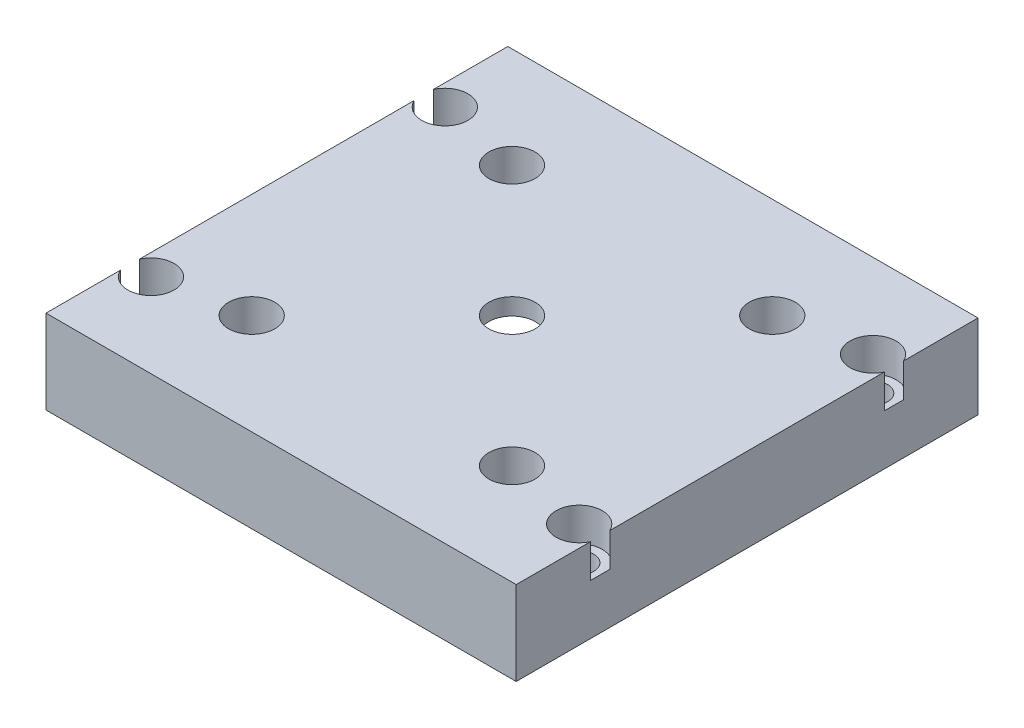
ISO-10303-21;
HEADER;
FILE_DESCRIPTION(('STEP AP214'),'2;1');
FILE_NAME('part.step','',(''),(''),'','','');
FILE_SCHEMA(('AUTOMOTIVE_DESIGN { 1 0 10303 214 1 1 1 1 }'));
ENDSEC;
DATA;
#1=APPLICATION_CONTEXT('core data for automotive mechanical design processes');
#2=APPLICATION_PROTOCOL_DEFINITION('international standard','automotive_design',2000,#1);
#3=PRODUCT_CONTEXT('',#1,'mechanical');
#4=PRODUCT('Part','Part','',(#3));
#5=PRODUCT_RELATED_PRODUCT_CATEGORY('part','',(#4));
#6=PRODUCT_DEFINITION_FORMATION('','',#4);
#7=PRODUCT_DEFINITION_CONTEXT('part definition',#1,'design');
#8=PRODUCT_DEFINITION('design','',#6,#7);
#9=PRODUCT_DEFINITION_SHAPE('','',#8);
#10=(LENGTH_UNIT() NAMED_UNIT(*) SI_UNIT(.MILLI.,.METRE.));
#11=(NAMED_UNIT(*) PLANE_ANGLE_UNIT() SI_UNIT($,.RADIAN.));
#12=(NAMED_UNIT(*) SI_UNIT($,.STERADIAN.) SOLID_ANGLE_UNIT());
#13=UNCERTAINTY_MEASURE_WITH_UNIT(LENGTH_MEASURE(1.E-05),#10,'distance_accuracy_value','');
#14=(GEOMETRIC_REPRESENTATION_CONTEXT(3) GLOBAL_UNCERTAINTY_ASSIGNED_CONTEXT((#13)) GLOBAL_UNIT_ASSIGNED_CONTEXT((#10,
#11,#12)) REPRESENTATION_CONTEXT('',''));
#15=CARTESIAN_POINT('',(0.,0.,0.));
#16=DIRECTION('',(0.,0.,1.));
#17=DIRECTION('',(1.,0.,0.));
#18=AXIS2_PLACEMENT_3D('',#15,#16,#17);
#19=CARTESIAN_POINT('',(25.5,-49.,17.5));
#20=DIRECTION('',(0.,1.,0.));
#21=DIRECTION('',(0.,0.,1.));
#22=AXIS2_PLACEMENT_3D('',#19,#20,#21);
#23=CYLINDRICAL_SURFACE('',#22,1.75);
#24=CARTESIAN_POINT('',(25.5,-5.,17.5));
#25=DIRECTION('',(0.,-1.,0.));
#26=DIRECTION('',(0.,0.,-1.));
#27=AXIS2_PLACEMENT_3D('',#24,#25,#26);
#28=CIRCLE('',#27,1.75);
#29=CARTESIAN_POINT('',(25.5,-5.,15.75));
#30=VERTEX_POINT('',#29);
#31=EDGE_CURVE('E299',#30,#30,#28,.T.);
#32=ORIENTED_EDGE('',*,*,#31,.T.);
#33=EDGE_LOOP('',(#32));
#34=FACE_BOUND('',#33,.T.);
#35=CARTESIAN_POINT('',(25.5,1.,17.5));
#36=DIRECTION('',(0.,1.,0.));
#37=DIRECTION('',(0.,0.,1.));
#38=AXIS2_PLACEMENT_3D('',#35,#36,#37);
#39=CIRCLE('',#38,1.75);
#40=CARTESIAN_POINT('',(25.5,1.,19.25));
#41=VERTEX_POINT('',#40);
#42=EDGE_CURVE('E51',#41,#41,#39,.F.);
#43=ORIENTED_EDGE('',*,*,#42,.F.);
#44=EDGE_LOOP('',(#43));
#45=FACE_BOUND('',#44,.T.);
#46=ADVANCED_FACE('F47',(#34,#45),#23,.F.);
#47=CARTESIAN_POINT('',(-25.5,-49.,17.5));
#48=DIRECTION('',(0.,1.,0.));
#49=DIRECTION('',(0.,0.,1.));
#50=AXIS2_PLACEMENT_3D('',#47,#48,#49);
#51=CYLINDRICAL_SURFACE('',#50,1.75);
#52=CARTESIAN_POINT('',(-25.5,-5.,17.5));
#53=DIRECTION('',(0.,-1.,0.));
#54=DIRECTION('',(0.,0.,-1.));
#55=AXIS2_PLACEMENT_3D('',#52,#53,#54);
#56=CIRCLE('',#55,1.75);
#57=CARTESIAN_POINT('',(-25.5,-5.,15.75));
#58=VERTEX_POINT('',#57);
#59=EDGE_CURVE('E303',#58,#58,#56,.T.);
#60=ORIENTED_EDGE('',*,*,#59,.T.);
#61=EDGE_LOOP('',(#60));
#62=FACE_BOUND('',#61,.T.);
#63=CARTESIAN_POINT('',(-25.5,1.,17.5));
#64=DIRECTION('',(0.,1.,0.));
#65=DIRECTION('',(0.,0.,1.));
#66=AXIS2_PLACEMENT_3D('',#63,#64,#65);
#67=CIRCLE('',#66,1.75);
#68=CARTESIAN_POINT('',(-25.5,1.,19.25));
#69=VERTEX_POINT('',#68);
#70=EDGE_CURVE('E321',#69,#69,#67,.F.);
#71=ORIENTED_EDGE('',*,*,#70,.F.);
#72=EDGE_LOOP('',(#71));
#73=FACE_BOUND('',#72,.T.);
#74=ADVANCED_FACE('F467',(#62,#73),#51,.F.);
#75=CARTESIAN_POINT('',(25.5,-49.,-17.5));
#76=DIRECTION('',(0.,1.,0.));
#77=DIRECTION('',(0.,0.,1.));
#78=AXIS2_PLACEMENT_3D('',#75,#76,#77);
#79=CYLINDRICAL_SURFACE('',#78,1.75);
#80=CARTESIAN_POINT('',(25.5,-5.,-17.5));
#81=DIRECTION('',(0.,-1.,0.));
#82=DIRECTION('',(0.,0.,-1.));
#83=AXIS2_PLACEMENT_3D('',#80,#81,#82);
#84=CIRCLE('',#83,1.75);
#85=CARTESIAN_POINT('',(25.5,-5.,-19.25));
#86=VERTEX_POINT('',#85);
#87=EDGE_CURVE('E307',#86,#86,#84,.T.);
#88=ORIENTED_EDGE('',*,*,#87,.T.);
#89=EDGE_LOOP('',(#88));
#90=FACE_BOUND('',#89,.T.);
#91=CARTESIAN_POINT('',(25.5,1.,-17.5));
#92=DIRECTION('',(0.,1.,0.));
#93=DIRECTION('',(0.,0.,1.));
#94=AXIS2_PLACEMENT_3D('',#91,#92,#93);
#95=CIRCLE('',#94,1.75);
#96=CARTESIAN_POINT('',(25.5,1.,-15.75));
#97=VERTEX_POINT('',#96);
#98=EDGE_CURVE('E181',#97,#97,#95,.F.);
#99=ORIENTED_EDGE('',*,*,#98,.F.);
#100=EDGE_LOOP('',(#99));
#101=FACE_BOUND('',#100,.T.);
#102=ADVANCED_FACE('F469',(#90,#101),#79,.F.);
#103=CARTESIAN_POINT('',(-25.5,-49.,-17.5));
#104=DIRECTION('',(0.,1.,0.));
#105=DIRECTION('',(0.,0.,1.));
#106=AXIS2_PLACEMENT_3D('',#103,#104,#105);
#107=CYLINDRICAL_SURFACE('',#106,1.75);
#108=CARTESIAN_POINT('',(-25.5,-5.,-17.5));
#109=DIRECTION('',(0.,-1.,0.));
#110=DIRECTION('',(0.,0.,-1.));
#111=AXIS2_PLACEMENT_3D('',#108,#109,#110);
#112=CIRCLE('',#111,1.75);
#113=CARTESIAN_POINT('',(-25.5,-5.,-19.25));
#114=VERTEX_POINT('',#113);
#115=EDGE_CURVE('E311',#114,#114,#112,.T.);
#116=ORIENTED_EDGE('',*,*,#115,.T.);
#117=EDGE_LOOP('',(#116));
#118=FACE_BOUND('',#117,.T.);
#119=CARTESIAN_POINT('',(-25.5,1.,-17.5));
#120=DIRECTION('',(0.,1.,0.));
#121=DIRECTION('',(0.,0.,1.));
#122=AXIS2_PLACEMENT_3D('',#119,#120,#121);
#123=CIRCLE('',#122,1.75);
#124=CARTESIAN_POINT('',(-25.5,1.,-15.75));
#125=VERTEX_POINT('',#124);
#126=EDGE_CURVE('E351',#125,#125,#123,.F.);
#127=ORIENTED_EDGE('',*,*,#126,.F.);
#128=EDGE_LOOP('',(#127));
#129=FACE_BOUND('',#128,.T.);
#130=ADVANCED_FACE('F476',(#118,#129),#107,.F.);
#131=CARTESIAN_POINT('',(-15.5,-7.,-15.5));
#132=DIRECTION('',(0.,1.,0.));
#133=DIRECTION('',(0.,0.,1.));
#134=AXIS2_PLACEMENT_3D('',#131,#132,#133);
#135=CYLINDRICAL_SURFACE('',#134,1.75);
#136=CARTESIAN_POINT('',(-15.5,0.,-15.5));
#137=DIRECTION('',(0.,1.,0.));
#138=DIRECTION('',(0.,0.,1.));
#139=AXIS2_PLACEMENT_3D('',#136,#137,#138);
#140=CIRCLE('',#139,1.75);
#141=CARTESIAN_POINT('',(-15.5,0.,-13.75));
#142=VERTEX_POINT('',#141);
#143=EDGE_CURVE('E287',#142,#142,#140,.T.);
#144=ORIENTED_EDGE('',*,*,#143,.F.);
#145=EDGE_LOOP('',(#144));
#146=FACE_BOUND('',#145,.T.);
#147=CARTESIAN_POINT('',(-15.5,1.,-15.5));
#148=DIRECTION('',(0.,1.,0.));
#149=DIRECTION('',(0.,0.,1.));
#150=AXIS2_PLACEMENT_3D('',#147,#148,#149);
#151=CIRCLE('',#150,1.75);
#152=CARTESIAN_POINT('',(-15.5,1.,-13.75));
#153=VERTEX_POINT('',#152);
#154=EDGE_CURVE('E449',#153,#153,#151,.F.);
#155=ORIENTED_EDGE('',*,*,#154,.F.);
#156=EDGE_LOOP('',(#155));
#157=FACE_BOUND('',#156,.T.);
#158=ADVANCED_FACE('F485',(#146,#157),#135,.F.);
#159=CARTESIAN_POINT('',(15.5,-7.,-15.5));
#160=DIRECTION('',(0.,1.,0.));
#161=DIRECTION('',(0.,0.,1.));
#162=AXIS2_PLACEMENT_3D('',#159,#160,#161);
#163=CYLINDRICAL_SURFACE('',#162,1.75);
#164=CARTESIAN_POINT('',(15.5,0.,-15.5));
#165=DIRECTION('',(0.,1.,0.));
#166=DIRECTION('',(0.,0.,1.));
#167=AXIS2_PLACEMENT_3D('',#164,#165,#166);
#168=CIRCLE('',#167,1.75);
#169=CARTESIAN_POINT('',(15.5,0.,-13.75));
#170=VERTEX_POINT('',#169);
#171=EDGE_CURVE('E283',#170,#170,#168,.T.);
#172=ORIENTED_EDGE('',*,*,#171,.F.);
#173=EDGE_LOOP('',(#172));
#174=FACE_BOUND('',#173,.T.);
#175=CARTESIAN_POINT('',(15.5,1.,-15.5));
#176=DIRECTION('',(0.,1.,0.));
#177=DIRECTION('',(0.,0.,1.));
#178=AXIS2_PLACEMENT_3D('',#175,#176,#177);
#179=CIRCLE('',#178,1.75);
#180=CARTESIAN_POINT('',(15.5,1.,-13.75));
#181=VERTEX_POINT('',#180);
#182=EDGE_CURVE('E445',#181,#181,#179,.F.);
#183=ORIENTED_EDGE('',*,*,#182,.F.);
#184=EDGE_LOOP('',(#183));
#185=FACE_BOUND('',#184,.T.);
#186=ADVANCED_FACE('F543',(#174,#185),#163,.F.);
#187=CARTESIAN_POINT('',(15.5,-7.,15.5));
#188=DIRECTION('',(0.,1.,0.));
#189=DIRECTION('',(0.,0.,1.));
#190=AXIS2_PLACEMENT_3D('',#187,#188,#189);
#191=CYLINDRICAL_SURFACE('',#190,1.75);
#192=CARTESIAN_POINT('',(15.5,0.,15.5));
#193=DIRECTION('',(0.,1.,0.));
#194=DIRECTION('',(0.,0.,1.));
#195=AXIS2_PLACEMENT_3D('',#192,#193,#194);
#196=CIRCLE('',#195,1.75);
#197=CARTESIAN_POINT('',(15.5,0.,17.25));
#198=VERTEX_POINT('',#197);
#199=EDGE_CURVE('E279',#198,#198,#196,.T.);
#200=ORIENTED_EDGE('',*,*,#199,.F.);
#201=EDGE_LOOP('',(#200));
#202=FACE_BOUND('',#201,.T.);
#203=CARTESIAN_POINT('',(15.5,1.,15.5));
#204=DIRECTION('',(0.,1.,0.));
#205=DIRECTION('',(0.,0.,1.));
#206=AXIS2_PLACEMENT_3D('',#203,#204,#205);
#207=CIRCLE('',#206,1.75);
#208=CARTESIAN_POINT('',(15.5,1.,17.25));
#209=VERTEX_POINT('',#208);
#210=EDGE_CURVE('E441',#209,#209,#207,.F.);
#211=ORIENTED_EDGE('',*,*,#210,.F.);
#212=EDGE_LOOP('',(#211));
#213=FACE_BOUND('',#212,.T.);
#214=ADVANCED_FACE('F539',(#202,#213),#191,.F.);
#215=CARTESIAN_POINT('',(-15.5,-7.,15.5));
#216=DIRECTION('',(0.,1.,0.));
#217=DIRECTION('',(0.,0.,1.));
#218=AXIS2_PLACEMENT_3D('',#215,#216,#217);
#219=CYLINDRICAL_SURFACE('',#218,1.75);
#220=CARTESIAN_POINT('',(-15.5,0.,15.5));
#221=DIRECTION('',(0.,1.,0.));
#222=DIRECTION('',(0.,0.,1.));
#223=AXIS2_PLACEMENT_3D('',#220,#221,#222);
#224=CIRCLE('',#223,1.75);
#225=CARTESIAN_POINT('',(-15.5,0.,17.25));
#226=VERTEX_POINT('',#225);
#227=EDGE_CURVE('E264',#226,#226,#224,.T.);
#228=ORIENTED_EDGE('',*,*,#227,.F.);
#229=EDGE_LOOP('',(#228));
#230=FACE_BOUND('',#229,.T.);
#231=CARTESIAN_POINT('',(-15.5,1.,15.5));
#232=DIRECTION('',(0.,1.,0.));
#233=DIRECTION('',(0.,0.,1.));
#234=AXIS2_PLACEMENT_3D('',#231,#232,#233);
#235=CIRCLE('',#234,1.75);
#236=CARTESIAN_POINT('',(-15.5,1.,17.25));
#237=VERTEX_POINT('',#236);
#238=EDGE_CURVE('E361',#237,#237,#235,.F.);
#239=ORIENTED_EDGE('',*,*,#238,.F.);
#240=EDGE_LOOP('',(#239));
#241=FACE_BOUND('',#240,.T.);
#242=ADVANCED_FACE('F503',(#230,#241),#219,.F.);
#243=CARTESIAN_POINT('',(0.,0.,0.));
#244=DIRECTION('',(0.,1.,0.));
#245=DIRECTION('',(0.,0.,1.));
#246=AXIS2_PLACEMENT_3D('',#243,#244,#245);
#247=PLANE('',#246);
#248=ORIENTED_EDGE('',*,*,#227,.T.);
#249=EDGE_LOOP('',(#248));
#250=FACE_BOUND('',#249,.T.);
#251=ORIENTED_EDGE('',*,*,#199,.T.);
#252=EDGE_LOOP('',(#251));
#253=FACE_BOUND('',#252,.T.);
#254=ORIENTED_EDGE('',*,*,#171,.T.);
#255=EDGE_LOOP('',(#254));
#256=FACE_BOUND('',#255,.T.);
#257=ORIENTED_EDGE('',*,*,#143,.T.);
#258=EDGE_LOOP('',(#257));
#259=FACE_BOUND('',#258,.T.);
#260=DIRECTION('',(0.,0.,1.));
#261=VECTOR('',#260,1.);
#262=CARTESIAN_POINT('',(23.,0.,-22.5));
#263=LINE('',#262,#261);
#264=CARTESIAN_POINT('',(23.,0.,-22.5));
#265=VERTEX_POINT('',#264);
#266=CARTESIAN_POINT('',(23.,0.,22.5));
#267=VERTEX_POINT('',#266);
#268=EDGE_CURVE('E247',#265,#267,#263,.T.);
#269=ORIENTED_EDGE('',*,*,#268,.T.);
#270=DIRECTION('',(-1.,0.,0.));
#271=VECTOR('',#270,1.);
#272=CARTESIAN_POINT('',(23.,0.,22.5));
#273=LINE('',#272,#271);
#274=CARTESIAN_POINT('',(-23.,0.,22.5));
#275=VERTEX_POINT('',#274);
#276=EDGE_CURVE('E260',#267,#275,#273,.T.);
#277=ORIENTED_EDGE('',*,*,#276,.T.);
#278=DIRECTION('',(0.,0.,-1.));
#279=VECTOR('',#278,1.);
#280=CARTESIAN_POINT('',(-23.,0.,22.5));
#281=LINE('',#280,#279);
#282=CARTESIAN_POINT('',(-23.,0.,-22.5));
#283=VERTEX_POINT('',#282);
#284=EDGE_CURVE('E256',#275,#283,#281,.T.);
#285=ORIENTED_EDGE('',*,*,#284,.T.);
#286=DIRECTION('',(1.,0.,0.));
#287=VECTOR('',#286,1.);
#288=CARTESIAN_POINT('',(-23.,0.,-22.5));
#289=LINE('',#288,#287);
#290=EDGE_CURVE('E252',#283,#265,#289,.T.);
#291=ORIENTED_EDGE('',*,*,#290,.T.);
#292=EDGE_LOOP('',(#269,#277,#285,#291));
#293=FACE_BOUND('',#292,.T.);
#294=CARTESIAN_POINT('',(0.,0.,0.));
#295=DIRECTION('',(0.,-1.,0.));
#296=DIRECTION('',(0.,0.,-1.));
#297=AXIS2_PLACEMENT_3D('',#294,#295,#296);
#298=CIRCLE('',#297,11.5);
#299=CARTESIAN_POINT('',(0.,0.,-11.5));
#300=VERTEX_POINT('',#299);
#301=EDGE_CURVE('E209',#300,#300,#298,.T.);
#302=ORIENTED_EDGE('',*,*,#301,.F.);
#303=EDGE_LOOP('',(#302));
#304=FACE_BOUND('',#303,.T.);
#305=ADVANCED_FACE('F495',(#250,#253,#256,#259,#293,#304),#247,.F.);
#306=CARTESIAN_POINT('',(0.,3.,0.));
#307=DIRECTION('',(0.,-1.,0.));
#308=DIRECTION('',(0.,0.,-1.));
#309=AXIS2_PLACEMENT_3D('',#306,#307,#308);
#310=CYLINDRICAL_SURFACE('',#309,11.5);
#311=CARTESIAN_POINT('',(0.,3.,0.));
#312=DIRECTION('',(0.,-1.,0.));
#313=DIRECTION('',(0.,0.,-1.));
#314=AXIS2_PLACEMENT_3D('',#311,#312,#313);
#315=CIRCLE('',#314,11.5);
#316=CARTESIAN_POINT('',(0.,3.,-11.5));
#317=VERTEX_POINT('',#316);
#318=EDGE_CURVE('E213',#317,#317,#315,.T.);
#319=ORIENTED_EDGE('',*,*,#318,.F.);
#320=EDGE_LOOP('',(#319));
#321=FACE_BOUND('',#320,.T.);
#322=ORIENTED_EDGE('',*,*,#301,.T.);
#323=EDGE_LOOP('',(#322));
#324=FACE_BOUND('',#323,.T.);
#325=ADVANCED_FACE('F491',(#321,#324),#310,.F.);
#326=CARTESIAN_POINT('',(0.,3.,0.));
#327=DIRECTION('',(0.,-1.,0.));
#328=DIRECTION('',(0.,0.,-1.));
#329=AXIS2_PLACEMENT_3D('',#326,#327,#328);
#330=PLANE('',#329);
#331=CARTESIAN_POINT('',(0.,3.,0.));
#332=DIRECTION('',(0.,-1.,0.));
#333=DIRECTION('',(0.,0.,-1.));
#334=AXIS2_PLACEMENT_3D('',#331,#332,#333);
#335=CIRCLE('',#334,2.75);
#336=CARTESIAN_POINT('',(0.,3.,-2.75));
#337=VERTEX_POINT('',#336);
#338=EDGE_CURVE('E291',#337,#337,#335,.T.);
#339=ORIENTED_EDGE('',*,*,#338,.F.);
#340=EDGE_LOOP('',(#339));
#341=FACE_BOUND('',#340,.T.);
#342=ORIENTED_EDGE('',*,*,#318,.T.);
#343=EDGE_LOOP('',(#342));
#344=FACE_BOUND('',#343,.T.);
#345=ADVANCED_FACE('F487',(#341,#344),#330,.T.);
#346=CARTESIAN_POINT('',(23.,-5.,-22.5));
#347=DIRECTION('',(-1.,0.,0.));
#348=DIRECTION('',(0.,0.,1.));
#349=AXIS2_PLACEMENT_3D('',#346,#347,#348);
#350=PLANE('',#349);
#351=ORIENTED_EDGE('',*,*,#268,.F.);
#352=DIRECTION('',(0.,1.,0.));
#353=VECTOR('',#352,1.);
#354=CARTESIAN_POINT('',(23.,-5.,-22.5));
#355=LINE('',#354,#353);
#356=CARTESIAN_POINT('',(23.,-5.,-22.5));
#357=VERTEX_POINT('',#356);
#358=EDGE_CURVE('E240',#357,#265,#355,.T.);
#359=ORIENTED_EDGE('',*,*,#358,.F.);
#360=DIRECTION('',(0.,0.,1.));
#361=VECTOR('',#360,1.);
#362=CARTESIAN_POINT('',(23.,-5.,-22.5));
#363=LINE('',#362,#361);
#364=CARTESIAN_POINT('',(23.,-5.,22.5));
#365=VERTEX_POINT('',#364);
#366=EDGE_CURVE('E246',#357,#365,#363,.T.);
#367=ORIENTED_EDGE('',*,*,#366,.T.);
#368=DIRECTION('',(0.,1.,0.));
#369=VECTOR('',#368,1.);
#370=CARTESIAN_POINT('',(23.,-5.,22.5));
#371=LINE('',#370,#369);
#372=EDGE_CURVE('E243',#365,#267,#371,.T.);
#373=ORIENTED_EDGE('',*,*,#372,.T.);
#374=EDGE_LOOP('',(#351,#359,#367,#373));
#375=FACE_BOUND('',#374,.T.);
#376=ADVANCED_FACE('F490',(#375),#350,.T.);
#377=CARTESIAN_POINT('',(-23.,-5.,-22.5));
#378=DIRECTION('',(0.,0.,1.));
#379=DIRECTION('',(1.,0.,0.));
#380=AXIS2_PLACEMENT_3D('',#377,#378,#379);
#381=PLANE('',#380);
#382=ORIENTED_EDGE('',*,*,#290,.F.);
#383=DIRECTION('',(0.,1.,0.));
#384=VECTOR('',#383,1.);
#385=CARTESIAN_POINT('',(-23.,-5.,-22.5));
#386=LINE('',#385,#384);
#387=CARTESIAN_POINT('',(-23.,-5.,-22.5));
#388=VERTEX_POINT('',#387);
#389=EDGE_CURVE('E237',#388,#283,#386,.T.);
#390=ORIENTED_EDGE('',*,*,#389,.F.);
#391=DIRECTION('',(1.,0.,0.));
#392=VECTOR('',#391,1.);
#393=CARTESIAN_POINT('',(-23.,-5.,-22.5));
#394=LINE('',#393,#392);
#395=EDGE_CURVE('E267',#388,#357,#394,.T.);
#396=ORIENTED_EDGE('',*,*,#395,.T.);
#397=ORIENTED_EDGE('',*,*,#358,.T.);
#398=EDGE_LOOP('',(#382,#390,#396,#397));
#399=FACE_BOUND('',#398,.T.);
#400=ADVANCED_FACE('F526',(#399),#381,.T.);
#401=CARTESIAN_POINT('',(-23.,-5.,22.5));
#402=DIRECTION('',(1.,0.,0.));
#403=DIRECTION('',(0.,0.,-1.));
#404=AXIS2_PLACEMENT_3D('',#401,#402,#403);
#405=PLANE('',#404);
#406=ORIENTED_EDGE('',*,*,#284,.F.);
#407=DIRECTION('',(0.,1.,0.));
#408=VECTOR('',#407,1.);
#409=CARTESIAN_POINT('',(-23.,-5.,22.5));
#410=LINE('',#409,#408);
#411=CARTESIAN_POINT('',(-23.,-5.,22.5));
#412=VERTEX_POINT('',#411);
#413=EDGE_CURVE('E233',#412,#275,#410,.T.);
#414=ORIENTED_EDGE('',*,*,#413,.F.);
#415=DIRECTION('',(0.,0.,-1.));
#416=VECTOR('',#415,1.);
#417=CARTESIAN_POINT('',(-23.,-5.,22.5));
#418=LINE('',#417,#416);
#419=EDGE_CURVE('E271',#412,#388,#418,.T.);
#420=ORIENTED_EDGE('',*,*,#419,.T.);
#421=ORIENTED_EDGE('',*,*,#389,.T.);
#422=EDGE_LOOP('',(#406,#414,#420,#421));
#423=FACE_BOUND('',#422,.T.);
#424=ADVANCED_FACE('F518',(#423),#405,.T.);
#425=CARTESIAN_POINT('',(23.,-5.,22.5));
#426=DIRECTION('',(0.,0.,-1.));
#427=DIRECTION('',(-1.,0.,0.));
#428=AXIS2_PLACEMENT_3D('',#425,#426,#427);
#429=PLANE('',#428);
#430=ORIENTED_EDGE('',*,*,#276,.F.);
#431=ORIENTED_EDGE('',*,*,#372,.F.);
#432=DIRECTION('',(-1.,0.,0.));
#433=VECTOR('',#432,1.);
#434=CARTESIAN_POINT('',(23.,-5.,22.5));
#435=LINE('',#434,#433);
#436=EDGE_CURVE('E251',#365,#412,#435,.T.);
#437=ORIENTED_EDGE('',*,*,#436,.T.);
#438=ORIENTED_EDGE('',*,*,#413,.T.);
#439=EDGE_LOOP('',(#430,#431,#437,#438));
#440=FACE_BOUND('',#439,.T.);
#441=ADVANCED_FACE('F513',(#440),#429,.T.);
#442=CARTESIAN_POINT('',(0.,-5.,0.));
#443=DIRECTION('',(0.,-1.,0.));
#444=DIRECTION('',(0.,0.,-1.));
#445=AXIS2_PLACEMENT_3D('',#442,#443,#444);
#446=PLANE('',#445);
#447=ORIENTED_EDGE('',*,*,#87,.F.);
#448=EDGE_LOOP('',(#447));
#449=FACE_BOUND('',#448,.T.);
#450=ORIENTED_EDGE('',*,*,#59,.F.);
#451=EDGE_LOOP('',(#450));
#452=FACE_BOUND('',#451,.T.);
#453=ORIENTED_EDGE('',*,*,#31,.F.);
#454=EDGE_LOOP('',(#453));
#455=FACE_BOUND('',#454,.T.);
#456=ORIENTED_EDGE('',*,*,#115,.F.);
#457=EDGE_LOOP('',(#456));
#458=FACE_BOUND('',#457,.T.);
#459=DIRECTION('',(0.,0.,1.));
#460=VECTOR('',#459,1.);
#461=CARTESIAN_POINT('',(28.,-5.,27.5));
#462=LINE('',#461,#460);
#463=CARTESIAN_POINT('',(28.,-5.,-27.5));
#464=VERTEX_POINT('',#463);
#465=CARTESIAN_POINT('',(28.,-5.,27.5));
#466=VERTEX_POINT('',#465);
#467=EDGE_CURVE('E229',#464,#466,#462,.T.);
#468=ORIENTED_EDGE('',*,*,#467,.T.);
#469=DIRECTION('',(-1.,0.,0.));
#470=VECTOR('',#469,1.);
#471=CARTESIAN_POINT('',(-28.,-5.,27.5));
#472=LINE('',#471,#470);
#473=CARTESIAN_POINT('',(-28.,-5.,27.5));
#474=VERTEX_POINT('',#473);
#475=EDGE_CURVE('E225',#466,#474,#472,.T.);
#476=ORIENTED_EDGE('',*,*,#475,.T.);
#477=DIRECTION('',(0.,0.,-1.));
#478=VECTOR('',#477,1.);
#479=CARTESIAN_POINT('',(-28.,-5.,27.5));
#480=LINE('',#479,#478);
#481=CARTESIAN_POINT('',(-28.,-5.,-27.5));
#482=VERTEX_POINT('',#481);
#483=EDGE_CURVE('E221',#474,#482,#480,.T.);
#484=ORIENTED_EDGE('',*,*,#483,.T.);
#485=DIRECTION('',(1.,0.,0.));
#486=VECTOR('',#485,1.);
#487=CARTESIAN_POINT('',(-28.,-5.,-27.5));
#488=LINE('',#487,#486);
#489=EDGE_CURVE('E214',#482,#464,#488,.T.);
#490=ORIENTED_EDGE('',*,*,#489,.T.);
#491=EDGE_LOOP('',(#468,#476,#484,#490));
#492=FACE_BOUND('',#491,.T.);
#493=ORIENTED_EDGE('',*,*,#419,.F.);
#494=ORIENTED_EDGE('',*,*,#436,.F.);
#495=ORIENTED_EDGE('',*,*,#366,.F.);
#496=ORIENTED_EDGE('',*,*,#395,.F.);
#497=EDGE_LOOP('',(#493,#494,#495,#496));
#498=FACE_BOUND('',#497,.T.);
#499=ADVANCED_FACE('F421',(#449,#452,#455,#458,#492,#498),#446,.T.);
#500=CARTESIAN_POINT('',(-28.,5.,-27.5));
#501=DIRECTION('',(0.,0.,1.));
#502=DIRECTION('',(1.,0.,0.));
#503=AXIS2_PLACEMENT_3D('',#500,#501,#502);
#504=PLANE('',#503);
#505=DIRECTION('',(0.,-1.,0.));
#506=VECTOR('',#505,1.);
#507=CARTESIAN_POINT('',(28.,5.,-27.5));
#508=LINE('',#507,#506);
#509=CARTESIAN_POINT('',(28.,5.,-27.5));
#510=VERTEX_POINT('',#509);
#511=EDGE_CURVE('E427',#510,#464,#508,.T.);
#512=ORIENTED_EDGE('',*,*,#511,.T.);
#513=ORIENTED_EDGE('',*,*,#489,.F.);
#514=DIRECTION('',(0.,-1.,0.));
#515=VECTOR('',#514,1.);
#516=CARTESIAN_POINT('',(-28.,5.,-27.5));
#517=LINE('',#516,#515);
#518=CARTESIAN_POINT('',(-28.,5.,-27.5));
#519=VERTEX_POINT('',#518);
#520=EDGE_CURVE('E426',#519,#482,#517,.T.);
#521=ORIENTED_EDGE('',*,*,#520,.F.);
#522=DIRECTION('',(-1.,0.,0.));
#523=VECTOR('',#522,1.);
#524=CARTESIAN_POINT('',(-28.,5.,-27.5));
#525=LINE('',#524,#523);
#526=EDGE_CURVE('E186',#510,#519,#525,.T.);
#527=ORIENTED_EDGE('',*,*,#526,.F.);
#528=EDGE_LOOP('',(#512,#513,#521,#527));
#529=FACE_BOUND('',#528,.T.);
#530=ADVANCED_FACE('F425',(#529),#504,.F.);
#531=CARTESIAN_POINT('',(-28.,5.,-27.5));
#532=DIRECTION('',(1.,0.,0.));
#533=DIRECTION('',(0.,0.,-1.));
#534=AXIS2_PLACEMENT_3D('',#531,#532,#533);
#535=PLANE('',#534);
#536=DIRECTION('',(0.,0.,1.));
#537=VECTOR('',#536,1.);
#538=CARTESIAN_POINT('',(-28.,1.,-27.5));
#539=LINE('',#538,#537);
#540=CARTESIAN_POINT('',(-28.,1.,-18.645643923739));
#541=VERTEX_POINT('',#540);
#542=CARTESIAN_POINT('',(-28.,1.,-16.354356076261));
#543=VERTEX_POINT('',#542);
#544=EDGE_CURVE('E179',#541,#543,#539,.T.);
#545=ORIENTED_EDGE('',*,*,#544,.F.);
#546=DIRECTION('',(0.,1.,0.));
#547=VECTOR('',#546,1.);
#548=CARTESIAN_POINT('',(-28.,1.,-18.645643923739));
#549=LINE('',#548,#547);
#550=CARTESIAN_POINT('',(-28.,5.,-18.645643923739));
#551=VERTEX_POINT('',#550);
#552=EDGE_CURVE('E164',#541,#551,#549,.T.);
#553=ORIENTED_EDGE('',*,*,#552,.T.);
#554=DIRECTION('',(0.,0.,1.));
#555=VECTOR('',#554,1.);
#556=CARTESIAN_POINT('',(-28.,5.,-27.5));
#557=LINE('',#556,#555);
#558=EDGE_CURVE('E178',#519,#551,#557,.T.);
#559=ORIENTED_EDGE('',*,*,#558,.F.);
#560=ORIENTED_EDGE('',*,*,#520,.T.);
#561=ORIENTED_EDGE('',*,*,#483,.F.);
#562=DIRECTION('',(0.,-1.,0.));
#563=VECTOR('',#562,1.);
#564=CARTESIAN_POINT('',(-28.,5.,27.5));
#565=LINE('',#564,#563);
#566=CARTESIAN_POINT('',(-28.,5.,27.5));
#567=VERTEX_POINT('',#566);
#568=EDGE_CURVE('E416',#567,#474,#565,.T.);
#569=ORIENTED_EDGE('',*,*,#568,.F.);
#570=CARTESIAN_POINT('',(-28.,5.,18.645643923739));
#571=VERTEX_POINT('',#570);
#572=EDGE_CURVE('E192',#571,#567,#557,.T.);
#573=ORIENTED_EDGE('',*,*,#572,.F.);
#574=DIRECTION('',(0.,1.,0.));
#575=VECTOR('',#574,1.);
#576=CARTESIAN_POINT('',(-28.,1.,18.645643923739));
#577=LINE('',#576,#575);
#578=CARTESIAN_POINT('',(-28.,1.,18.645643923739));
#579=VERTEX_POINT('',#578);
#580=EDGE_CURVE('E65',#571,#579,#577,.F.);
#581=ORIENTED_EDGE('',*,*,#580,.T.);
#582=DIRECTION('',(0.,0.,1.));
#583=VECTOR('',#582,1.);
#584=CARTESIAN_POINT('',(-28.,1.,-27.5));
#585=LINE('',#584,#583);
#586=CARTESIAN_POINT('',(-28.,1.,16.354356076261));
#587=VERTEX_POINT('',#586);
#588=EDGE_CURVE('E318',#587,#579,#585,.T.);
#589=ORIENTED_EDGE('',*,*,#588,.F.);
#590=DIRECTION('',(0.,1.,0.));
#591=VECTOR('',#590,1.);
#592=CARTESIAN_POINT('',(-28.,1.,16.354356076261));
#593=LINE('',#592,#591);
#594=CARTESIAN_POINT('',(-28.,5.,16.354356076261));
#595=VERTEX_POINT('',#594);
#596=EDGE_CURVE('E343',#587,#595,#593,.T.);
#597=ORIENTED_EDGE('',*,*,#596,.T.);
#598=CARTESIAN_POINT('',(-28.,5.,-16.354356076261));
#599=VERTEX_POINT('',#598);
#600=EDGE_CURVE('E190',#599,#595,#557,.T.);
#601=ORIENTED_EDGE('',*,*,#600,.F.);
#602=DIRECTION('',(0.,1.,0.));
#603=VECTOR('',#602,1.);
#604=CARTESIAN_POINT('',(-28.,1.,-16.354356076261));
#605=LINE('',#604,#603);
#606=EDGE_CURVE('E73',#599,#543,#605,.F.);
#607=ORIENTED_EDGE('',*,*,#606,.T.);
#608=EDGE_LOOP('',(#545,#553,#559,#560,#561,#569,#573,#581,#589,#597,#601,#607));
#609=FACE_BOUND('',#608,.T.);
#610=ADVANCED_FACE('F177',(#609),#535,.F.);
#611=CARTESIAN_POINT('',(-28.,5.,27.5));
#612=DIRECTION('',(0.,0.,-1.));
#613=DIRECTION('',(-1.,0.,0.));
#614=AXIS2_PLACEMENT_3D('',#611,#612,#613);
#615=PLANE('',#614);
#616=ORIENTED_EDGE('',*,*,#568,.T.);
#617=ORIENTED_EDGE('',*,*,#475,.F.);
#618=DIRECTION('',(0.,-1.,0.));
#619=VECTOR('',#618,1.);
#620=CARTESIAN_POINT('',(28.,5.,27.5));
#621=LINE('',#620,#619);
#622=CARTESIAN_POINT('',(28.,5.,27.5));
#623=VERTEX_POINT('',#622);
#624=EDGE_CURVE('E195',#623,#466,#621,.T.);
#625=ORIENTED_EDGE('',*,*,#624,.F.);
#626=DIRECTION('',(1.,0.,0.));
#627=VECTOR('',#626,1.);
#628=CARTESIAN_POINT('',(-28.,5.,27.5));
#629=LINE('',#628,#627);
#630=EDGE_CURVE('E189',#567,#623,#629,.T.);
#631=ORIENTED_EDGE('',*,*,#630,.F.);
#632=EDGE_LOOP('',(#616,#617,#625,#631));
#633=FACE_BOUND('',#632,.T.);
#634=ADVANCED_FACE('F418',(#633),#615,.F.);
#635=CARTESIAN_POINT('',(28.,5.,-27.5));
#636=DIRECTION('',(-1.,0.,0.));
#637=DIRECTION('',(0.,0.,1.));
#638=AXIS2_PLACEMENT_3D('',#635,#636,#637);
#639=PLANE('',#638);
#640=DIRECTION('',(0.,0.,-1.));
#641=VECTOR('',#640,1.);
#642=CARTESIAN_POINT('',(28.,1.,-27.5));
#643=LINE('',#642,#641);
#644=CARTESIAN_POINT('',(28.,1.,18.645643923739));
#645=VERTEX_POINT('',#644);
#646=CARTESIAN_POINT('',(28.,1.,16.354356076261));
#647=VERTEX_POINT('',#646);
#648=EDGE_CURVE('E315',#645,#647,#643,.T.);
#649=ORIENTED_EDGE('',*,*,#648,.F.);
#650=DIRECTION('',(0.,1.,0.));
#651=VECTOR('',#650,1.);
#652=CARTESIAN_POINT('',(28.,1.,18.645643923739));
#653=LINE('',#652,#651);
#654=CARTESIAN_POINT('',(28.,5.,18.645643923739));
#655=VERTEX_POINT('',#654);
#656=EDGE_CURVE('E327',#645,#655,#653,.T.);
#657=ORIENTED_EDGE('',*,*,#656,.T.);
#658=DIRECTION('',(0.,0.,-1.));
#659=VECTOR('',#658,1.);
#660=CARTESIAN_POINT('',(28.,5.,-27.5));
#661=LINE('',#660,#659);
#662=EDGE_CURVE('E202',#623,#655,#661,.T.);
#663=ORIENTED_EDGE('',*,*,#662,.F.);
#664=ORIENTED_EDGE('',*,*,#624,.T.);
#665=ORIENTED_EDGE('',*,*,#467,.F.);
#666=ORIENTED_EDGE('',*,*,#511,.F.);
#667=CARTESIAN_POINT('',(28.,5.,-18.645643923739));
#668=VERTEX_POINT('',#667);
#669=EDGE_CURVE('E207',#668,#510,#661,.T.);
#670=ORIENTED_EDGE('',*,*,#669,.F.);
#671=DIRECTION('',(0.,1.,0.));
#672=VECTOR('',#671,1.);
#673=CARTESIAN_POINT('',(28.,1.,-18.645643923739));
#674=LINE('',#673,#672);
#675=CARTESIAN_POINT('',(28.,1.,-18.645643923739));
#676=VERTEX_POINT('',#675);
#677=EDGE_CURVE('E339',#668,#676,#674,.F.);
#678=ORIENTED_EDGE('',*,*,#677,.T.);
#679=DIRECTION('',(0.,0.,-1.));
#680=VECTOR('',#679,1.);
#681=CARTESIAN_POINT('',(28.,1.,-27.5));
#682=LINE('',#681,#680);
#683=CARTESIAN_POINT('',(28.,1.,-16.354356076261));
#684=VERTEX_POINT('',#683);
#685=EDGE_CURVE('E322',#684,#676,#682,.T.);
#686=ORIENTED_EDGE('',*,*,#685,.F.);
#687=DIRECTION('',(0.,1.,0.));
#688=VECTOR('',#687,1.);
#689=CARTESIAN_POINT('',(28.,1.,-16.354356076261));
#690=LINE('',#689,#688);
#691=CARTESIAN_POINT('',(28.,5.,-16.354356076261));
#692=VERTEX_POINT('',#691);
#693=EDGE_CURVE('E335',#684,#692,#690,.T.);
#694=ORIENTED_EDGE('',*,*,#693,.T.);
#695=CARTESIAN_POINT('',(28.,5.,16.354356076261));
#696=VERTEX_POINT('',#695);
#697=EDGE_CURVE('E205',#696,#692,#661,.T.);
#698=ORIENTED_EDGE('',*,*,#697,.F.);
#699=DIRECTION('',(0.,1.,0.));
#700=VECTOR('',#699,1.);
#701=CARTESIAN_POINT('',(28.,1.,16.354356076261));
#702=LINE('',#701,#700);
#703=EDGE_CURVE('E331',#696,#647,#702,.F.);
#704=ORIENTED_EDGE('',*,*,#703,.T.);
#705=EDGE_LOOP('',(#649,#657,#663,#664,#665,#666,#670,#678,#686,#694,#698,#704));
#706=FACE_BOUND('',#705,.T.);
#707=ADVANCED_FACE('F49',(#706),#639,.F.);
#708=CARTESIAN_POINT('',(0.,5.,0.));
#709=DIRECTION('',(0.,1.,0.));
#710=DIRECTION('',(0.,0.,1.));
#711=AXIS2_PLACEMENT_3D('',#708,#709,#710);
#712=PLANE('',#711);
#713=CARTESIAN_POINT('',(15.5,5.,-15.5));
#714=DIRECTION('',(0.,1.,0.));
#715=DIRECTION('',(0.,0.,1.));
#716=AXIS2_PLACEMENT_3D('',#713,#714,#715);
#717=CIRCLE('',#716,2.75);
#718=CARTESIAN_POINT('',(15.5,5.,-12.75));
#719=VERTEX_POINT('',#718);
#720=EDGE_CURVE('E357',#719,#719,#717,.T.);
#721=ORIENTED_EDGE('',*,*,#720,.F.);
#722=EDGE_LOOP('',(#721));
#723=FACE_BOUND('',#722,.T.);
#724=CARTESIAN_POINT('',(15.5,5.,15.5));
#725=DIRECTION('',(0.,1.,0.));
#726=DIRECTION('',(0.,0.,1.));
#727=AXIS2_PLACEMENT_3D('',#724,#725,#726);
#728=CIRCLE('',#727,2.75);
#729=CARTESIAN_POINT('',(15.5,5.,18.25));
#730=VERTEX_POINT('',#729);
#731=EDGE_CURVE('E376',#730,#730,#728,.T.);
#732=ORIENTED_EDGE('',*,*,#731,.F.);
#733=EDGE_LOOP('',(#732));
#734=FACE_BOUND('',#733,.T.);
#735=CARTESIAN_POINT('',(-15.5,5.,15.5));
#736=DIRECTION('',(0.,1.,0.));
#737=DIRECTION('',(0.,0.,1.));
#738=AXIS2_PLACEMENT_3D('',#735,#736,#737);
#739=CIRCLE('',#738,2.75);
#740=CARTESIAN_POINT('',(-15.5,5.,18.25));
#741=VERTEX_POINT('',#740);
#742=EDGE_CURVE('E368',#741,#741,#739,.T.);
#743=ORIENTED_EDGE('',*,*,#742,.F.);
#744=EDGE_LOOP('',(#743));
#745=FACE_BOUND('',#744,.T.);
#746=CARTESIAN_POINT('',(-25.5,5.,-17.5));
#747=DIRECTION('',(0.,1.,0.));
#748=DIRECTION('',(0.,0.,1.));
#749=AXIS2_PLACEMENT_3D('',#746,#747,#748);
#750=CIRCLE('',#749,2.75);
#751=EDGE_CURVE('E161',#599,#551,#750,.T.);
#752=ORIENTED_EDGE('',*,*,#751,.F.);
#753=ORIENTED_EDGE('',*,*,#600,.T.);
#754=CARTESIAN_POINT('',(-25.5,5.,17.5));
#755=DIRECTION('',(0.,1.,0.));
#756=DIRECTION('',(0.,0.,1.));
#757=AXIS2_PLACEMENT_3D('',#754,#755,#756);
#758=CIRCLE('',#757,2.75);
#759=EDGE_CURVE('E430',#571,#595,#758,.T.);
#760=ORIENTED_EDGE('',*,*,#759,.F.);
#761=ORIENTED_EDGE('',*,*,#572,.T.);
#762=ORIENTED_EDGE('',*,*,#630,.T.);
#763=ORIENTED_EDGE('',*,*,#662,.T.);
#764=CARTESIAN_POINT('',(25.5,5.,17.5));
#765=DIRECTION('',(0.,1.,0.));
#766=DIRECTION('',(0.,0.,1.));
#767=AXIS2_PLACEMENT_3D('',#764,#765,#766);
#768=CIRCLE('',#767,2.75);
#769=EDGE_CURVE('E11',#696,#655,#768,.T.);
#770=ORIENTED_EDGE('',*,*,#769,.F.);
#771=ORIENTED_EDGE('',*,*,#697,.T.);
#772=CARTESIAN_POINT('',(25.5,5.,-17.5));
#773=DIRECTION('',(0.,1.,0.));
#774=DIRECTION('',(0.,0.,1.));
#775=AXIS2_PLACEMENT_3D('',#772,#773,#774);
#776=CIRCLE('',#775,2.75);
#777=EDGE_CURVE('E57',#668,#692,#776,.T.);
#778=ORIENTED_EDGE('',*,*,#777,.F.);
#779=ORIENTED_EDGE('',*,*,#669,.T.);
#780=ORIENTED_EDGE('',*,*,#526,.T.);
#781=ORIENTED_EDGE('',*,*,#558,.T.);
#782=EDGE_LOOP('',(#752,#753,#760,#761,#762,#763,#770,#771,#778,#779,#780,#781));
#783=FACE_BOUND('',#782,.T.);
#784=CARTESIAN_POINT('',(-15.5,5.,-15.5));
#785=DIRECTION('',(0.,1.,0.));
#786=DIRECTION('',(0.,0.,1.));
#787=AXIS2_PLACEMENT_3D('',#784,#785,#786);
#788=CIRCLE('',#787,2.75);
#789=CARTESIAN_POINT('',(-15.5,5.,-12.75));
#790=VERTEX_POINT('',#789);
#791=EDGE_CURVE('E352',#790,#790,#788,.T.);
#792=ORIENTED_EDGE('',*,*,#791,.F.);
#793=EDGE_LOOP('',(#792));
#794=FACE_BOUND('',#793,.T.);
#795=CARTESIAN_POINT('',(0.,5.,0.));
#796=DIRECTION('',(0.,1.,0.));
#797=DIRECTION('',(0.,0.,1.));
#798=AXIS2_PLACEMENT_3D('',#795,#796,#797);
#799=CIRCLE('',#798,2.75);
#800=CARTESIAN_POINT('',(0.,5.,2.75));
#801=VERTEX_POINT('',#800);
#802=EDGE_CURVE('E295',#801,#801,#799,.T.);
#803=ORIENTED_EDGE('',*,*,#802,.F.);
#804=EDGE_LOOP('',(#803));
#805=FACE_BOUND('',#804,.T.);
#806=ADVANCED_FACE('F183',(#723,#734,#745,#783,#794,#805),#712,.T.);
#807=CARTESIAN_POINT('',(0.,-7.,0.));
#808=DIRECTION('',(0.,1.,0.));
#809=DIRECTION('',(0.,0.,1.));
#810=AXIS2_PLACEMENT_3D('',#807,#808,#809);
#811=CYLINDRICAL_SURFACE('',#810,2.75);
#812=ORIENTED_EDGE('',*,*,#338,.T.);
#813=EDGE_LOOP('',(#812));
#814=FACE_BOUND('',#813,.T.);
#815=ORIENTED_EDGE('',*,*,#802,.T.);
#816=EDGE_LOOP('',(#815));
#817=FACE_BOUND('',#816,.T.);
#818=ADVANCED_FACE('F499',(#814,#817),#811,.F.);
#819=CARTESIAN_POINT('',(-15.5,1.,15.5));
#820=DIRECTION('',(0.,1.,0.));
#821=DIRECTION('',(0.,0.,1.));
#822=AXIS2_PLACEMENT_3D('',#819,#820,#821);
#823=PLANE('',#822);
#824=CARTESIAN_POINT('',(-15.5,1.,15.5));
#825=DIRECTION('',(0.,1.,0.));
#826=DIRECTION('',(0.,0.,1.));
#827=AXIS2_PLACEMENT_3D('',#824,#825,#826);
#828=CIRCLE('',#827,2.75);
#829=CARTESIAN_POINT('',(-15.5,1.,18.25));
#830=VERTEX_POINT('',#829);
#831=EDGE_CURVE('E171',#830,#830,#828,.T.);
#832=ORIENTED_EDGE('',*,*,#831,.T.);
#833=EDGE_LOOP('',(#832));
#834=FACE_BOUND('',#833,.T.);
#835=ORIENTED_EDGE('',*,*,#238,.T.);
#836=EDGE_LOOP('',(#835));
#837=FACE_BOUND('',#836,.T.);
#838=ADVANCED_FACE('F535',(#834,#837),#823,.T.);
#839=CARTESIAN_POINT('',(-15.5,1.,15.5));
#840=DIRECTION('',(0.,1.,0.));
#841=DIRECTION('',(0.,0.,1.));
#842=AXIS2_PLACEMENT_3D('',#839,#840,#841);
#843=CYLINDRICAL_SURFACE('',#842,2.75);
#844=ORIENTED_EDGE('',*,*,#831,.F.);
#845=EDGE_LOOP('',(#844));
#846=FACE_BOUND('',#845,.T.);
#847=ORIENTED_EDGE('',*,*,#742,.T.);
#848=EDGE_LOOP('',(#847));
#849=FACE_BOUND('',#848,.T.);
#850=ADVANCED_FACE('F568',(#846,#849),#843,.F.);
#851=CARTESIAN_POINT('',(15.5,1.,15.5));
#852=DIRECTION('',(0.,1.,0.));
#853=DIRECTION('',(0.,0.,1.));
#854=AXIS2_PLACEMENT_3D('',#851,#852,#853);
#855=PLANE('',#854);
#856=CARTESIAN_POINT('',(15.5,1.,15.5));
#857=DIRECTION('',(0.,1.,0.));
#858=DIRECTION('',(0.,0.,1.));
#859=AXIS2_PLACEMENT_3D('',#856,#857,#858);
#860=CIRCLE('',#859,2.75);
#861=CARTESIAN_POINT('',(15.5,1.,18.25));
#862=VERTEX_POINT('',#861);
#863=EDGE_CURVE('E372',#862,#862,#860,.T.);
#864=ORIENTED_EDGE('',*,*,#863,.T.);
#865=EDGE_LOOP('',(#864));
#866=FACE_BOUND('',#865,.T.);
#867=ORIENTED_EDGE('',*,*,#210,.T.);
#868=EDGE_LOOP('',(#867));
#869=FACE_BOUND('',#868,.T.);
#870=ADVANCED_FACE('F572',(#866,#869),#855,.T.);
#871=CARTESIAN_POINT('',(15.5,1.,15.5));
#872=DIRECTION('',(0.,1.,0.));
#873=DIRECTION('',(0.,0.,1.));
#874=AXIS2_PLACEMENT_3D('',#871,#872,#873);
#875=CYLINDRICAL_SURFACE('',#874,2.75);
#876=ORIENTED_EDGE('',*,*,#863,.F.);
#877=EDGE_LOOP('',(#876));
#878=FACE_BOUND('',#877,.T.);
#879=ORIENTED_EDGE('',*,*,#731,.T.);
#880=EDGE_LOOP('',(#879));
#881=FACE_BOUND('',#880,.T.);
#882=ADVANCED_FACE('F576',(#878,#881),#875,.F.);
#883=CARTESIAN_POINT('',(15.5,1.,-15.5));
#884=DIRECTION('',(0.,1.,0.));
#885=DIRECTION('',(0.,0.,1.));
#886=AXIS2_PLACEMENT_3D('',#883,#884,#885);
#887=PLANE('',#886);
#888=CARTESIAN_POINT('',(15.5,1.,-15.5));
#889=DIRECTION('',(0.,1.,0.));
#890=DIRECTION('',(0.,0.,1.));
#891=AXIS2_PLACEMENT_3D('',#888,#889,#890);
#892=CIRCLE('',#891,2.75);
#893=CARTESIAN_POINT('',(15.5,1.,-12.75));
#894=VERTEX_POINT('',#893);
#895=EDGE_CURVE('E380',#894,#894,#892,.T.);
#896=ORIENTED_EDGE('',*,*,#895,.T.);
#897=EDGE_LOOP('',(#896));
#898=FACE_BOUND('',#897,.T.);
#899=ORIENTED_EDGE('',*,*,#182,.T.);
#900=EDGE_LOOP('',(#899));
#901=FACE_BOUND('',#900,.T.);
#902=ADVANCED_FACE('F580',(#898,#901),#887,.T.);
#903=CARTESIAN_POINT('',(15.5,1.,-15.5));
#904=DIRECTION('',(0.,1.,0.));
#905=DIRECTION('',(0.,0.,1.));
#906=AXIS2_PLACEMENT_3D('',#903,#904,#905);
#907=CYLINDRICAL_SURFACE('',#906,2.75);
#908=ORIENTED_EDGE('',*,*,#895,.F.);
#909=EDGE_LOOP('',(#908));
#910=FACE_BOUND('',#909,.T.);
#911=ORIENTED_EDGE('',*,*,#720,.T.);
#912=EDGE_LOOP('',(#911));
#913=FACE_BOUND('',#912,.T.);
#914=ADVANCED_FACE('F558',(#910,#913),#907,.F.);
#915=CARTESIAN_POINT('',(-15.5,1.,-15.5));
#916=DIRECTION('',(0.,1.,0.));
#917=DIRECTION('',(0.,0.,1.));
#918=AXIS2_PLACEMENT_3D('',#915,#916,#917);
#919=PLANE('',#918);
#920=CARTESIAN_POINT('',(-15.5,1.,-15.5));
#921=DIRECTION('',(0.,1.,0.));
#922=DIRECTION('',(0.,0.,1.));
#923=AXIS2_PLACEMENT_3D('',#920,#921,#922);
#924=CIRCLE('',#923,2.75);
#925=CARTESIAN_POINT('',(-15.5,1.,-12.75));
#926=VERTEX_POINT('',#925);
#927=EDGE_CURVE('E356',#926,#926,#924,.T.);
#928=ORIENTED_EDGE('',*,*,#927,.T.);
#929=EDGE_LOOP('',(#928));
#930=FACE_BOUND('',#929,.T.);
#931=ORIENTED_EDGE('',*,*,#154,.T.);
#932=EDGE_LOOP('',(#931));
#933=FACE_BOUND('',#932,.T.);
#934=ADVANCED_FACE('F554',(#930,#933),#919,.T.);
#935=CARTESIAN_POINT('',(-15.5,1.,-15.5));
#936=DIRECTION('',(0.,1.,0.));
#937=DIRECTION('',(0.,0.,1.));
#938=AXIS2_PLACEMENT_3D('',#935,#936,#937);
#939=CYLINDRICAL_SURFACE('',#938,2.75);
#940=ORIENTED_EDGE('',*,*,#927,.F.);
#941=EDGE_LOOP('',(#940));
#942=FACE_BOUND('',#941,.T.);
#943=ORIENTED_EDGE('',*,*,#791,.T.);
#944=EDGE_LOOP('',(#943));
#945=FACE_BOUND('',#944,.T.);
#946=ADVANCED_FACE('F551',(#942,#945),#939,.F.);
#947=CARTESIAN_POINT('',(-25.5,1.,-17.5));
#948=DIRECTION('',(0.,1.,0.));
#949=DIRECTION('',(0.,0.,1.));
#950=AXIS2_PLACEMENT_3D('',#947,#948,#949);
#951=CYLINDRICAL_SURFACE('',#950,2.75);
#952=CARTESIAN_POINT('',(-25.5,1.,-17.5));
#953=DIRECTION('',(0.,1.,0.));
#954=DIRECTION('',(0.,0.,1.));
#955=AXIS2_PLACEMENT_3D('',#952,#953,#954);
#956=CIRCLE('',#955,2.75);
#957=EDGE_CURVE('E172',#543,#541,#956,.T.);
#958=ORIENTED_EDGE('',*,*,#957,.F.);
#959=ORIENTED_EDGE('',*,*,#606,.F.);
#960=ORIENTED_EDGE('',*,*,#751,.T.);
#961=ORIENTED_EDGE('',*,*,#552,.F.);
#962=EDGE_LOOP('',(#958,#959,#960,#961));
#963=FACE_BOUND('',#962,.T.);
#964=ADVANCED_FACE('F163',(#963),#951,.F.);
#965=CARTESIAN_POINT('',(-25.5,1.,-17.5));
#966=DIRECTION('',(0.,1.,0.));
#967=DIRECTION('',(0.,0.,1.));
#968=AXIS2_PLACEMENT_3D('',#965,#966,#967);
#969=PLANE('',#968);
#970=ORIENTED_EDGE('',*,*,#126,.T.);
#971=EDGE_LOOP('',(#970));
#972=FACE_BOUND('',#971,.T.);
#973=ORIENTED_EDGE('',*,*,#544,.T.);
#974=ORIENTED_EDGE('',*,*,#957,.T.);
#975=EDGE_LOOP('',(#973,#974));
#976=FACE_BOUND('',#975,.T.);
#977=ADVANCED_FACE('F560',(#972,#976),#969,.T.);
#978=CARTESIAN_POINT('',(-25.5,1.,17.5));
#979=DIRECTION('',(0.,1.,0.));
#980=DIRECTION('',(0.,0.,1.));
#981=AXIS2_PLACEMENT_3D('',#978,#979,#980);
#982=PLANE('',#981);
#983=ORIENTED_EDGE('',*,*,#70,.T.);
#984=EDGE_LOOP('',(#983));
#985=FACE_BOUND('',#984,.T.);
#986=ORIENTED_EDGE('',*,*,#588,.T.);
#987=CARTESIAN_POINT('',(-25.5,1.,17.5));
#988=DIRECTION('',(0.,1.,0.));
#989=DIRECTION('',(0.,0.,1.));
#990=AXIS2_PLACEMENT_3D('',#987,#988,#989);
#991=CIRCLE('',#990,2.75);
#992=EDGE_CURVE('E363',#579,#587,#991,.T.);
#993=ORIENTED_EDGE('',*,*,#992,.T.);
#994=EDGE_LOOP('',(#986,#993));
#995=FACE_BOUND('',#994,.T.);
#996=ADVANCED_FACE('F464',(#985,#995),#982,.T.);
#997=CARTESIAN_POINT('',(-25.5,1.,17.5));
#998=DIRECTION('',(0.,1.,0.));
#999=DIRECTION('',(0.,0.,1.));
#1000=AXIS2_PLACEMENT_3D('',#997,#998,#999);
#1001=CYLINDRICAL_SURFACE('',#1000,2.75);
#1002=ORIENTED_EDGE('',*,*,#992,.F.);
#1003=ORIENTED_EDGE('',*,*,#580,.F.);
#1004=ORIENTED_EDGE('',*,*,#759,.T.);
#1005=ORIENTED_EDGE('',*,*,#596,.F.);
#1006=EDGE_LOOP('',(#1002,#1003,#1004,#1005));
#1007=FACE_BOUND('',#1006,.T.);
#1008=ADVANCED_FACE('F592',(#1007),#1001,.F.);
#1009=CARTESIAN_POINT('',(25.5,1.,-17.5));
#1010=DIRECTION('',(0.,1.,0.));
#1011=DIRECTION('',(0.,0.,1.));
#1012=AXIS2_PLACEMENT_3D('',#1009,#1010,#1011);
#1013=PLANE('',#1012);
#1014=ORIENTED_EDGE('',*,*,#98,.T.);
#1015=EDGE_LOOP('',(#1014));
#1016=FACE_BOUND('',#1015,.T.);
#1017=ORIENTED_EDGE('',*,*,#685,.T.);
#1018=CARTESIAN_POINT('',(25.5,1.,-17.5));
#1019=DIRECTION('',(0.,1.,0.));
#1020=DIRECTION('',(0.,0.,1.));
#1021=AXIS2_PLACEMENT_3D('',#1018,#1019,#1020);
#1022=CIRCLE('',#1021,2.75);
#1023=EDGE_CURVE('E387',#676,#684,#1022,.T.);
#1024=ORIENTED_EDGE('',*,*,#1023,.T.);
#1025=EDGE_LOOP('',(#1017,#1024));
#1026=FACE_BOUND('',#1025,.T.);
#1027=ADVANCED_FACE('F588',(#1016,#1026),#1013,.T.);
#1028=CARTESIAN_POINT('',(25.5,1.,-17.5));
#1029=DIRECTION('',(0.,1.,0.));
#1030=DIRECTION('',(0.,0.,1.));
#1031=AXIS2_PLACEMENT_3D('',#1028,#1029,#1030);
#1032=CYLINDRICAL_SURFACE('',#1031,2.75);
#1033=ORIENTED_EDGE('',*,*,#1023,.F.);
#1034=ORIENTED_EDGE('',*,*,#677,.F.);
#1035=ORIENTED_EDGE('',*,*,#777,.T.);
#1036=ORIENTED_EDGE('',*,*,#693,.F.);
#1037=EDGE_LOOP('',(#1033,#1034,#1035,#1036));
#1038=FACE_BOUND('',#1037,.T.);
#1039=ADVANCED_FACE('F591',(#1038),#1032,.F.);
#1040=CARTESIAN_POINT('',(25.5,1.,17.5));
#1041=DIRECTION('',(0.,1.,0.));
#1042=DIRECTION('',(0.,0.,1.));
#1043=AXIS2_PLACEMENT_3D('',#1040,#1041,#1042);
#1044=PLANE('',#1043);
#1045=ORIENTED_EDGE('',*,*,#42,.T.);
#1046=EDGE_LOOP('',(#1045));
#1047=FACE_BOUND('',#1046,.T.);
#1048=ORIENTED_EDGE('',*,*,#648,.T.);
#1049=CARTESIAN_POINT('',(25.5,1.,17.5));
#1050=DIRECTION('',(0.,1.,0.));
#1051=DIRECTION('',(0.,0.,1.));
#1052=AXIS2_PLACEMENT_3D('',#1049,#1050,#1051);
#1053=CIRCLE('',#1052,2.75);
#1054=EDGE_CURVE('E391',#647,#645,#1053,.T.);
#1055=ORIENTED_EDGE('',*,*,#1054,.T.);
#1056=EDGE_LOOP('',(#1048,#1055));
#1057=FACE_BOUND('',#1056,.T.);
#1058=ADVANCED_FACE('F400',(#1047,#1057),#1044,.T.);
#1059=CARTESIAN_POINT('',(25.5,1.,17.5));
#1060=DIRECTION('',(0.,1.,0.));
#1061=DIRECTION('',(0.,0.,1.));
#1062=AXIS2_PLACEMENT_3D('',#1059,#1060,#1061);
#1063=CYLINDRICAL_SURFACE('',#1062,2.75);
#1064=ORIENTED_EDGE('',*,*,#1054,.F.);
#1065=ORIENTED_EDGE('',*,*,#703,.F.);
#1066=ORIENTED_EDGE('',*,*,#769,.T.);
#1067=ORIENTED_EDGE('',*,*,#656,.F.);
#1068=EDGE_LOOP('',(#1064,#1065,#1066,#1067));
#1069=FACE_BOUND('',#1068,.T.);
#1070=ADVANCED_FACE('F407',(#1069),#1063,.F.);
#1071=CLOSED_SHELL('',(#46,#74,#102,#130,#158,#186,#214,#242,#305,#325,#345,#376,#400,#424,#441,
#499,#530,#610,#634,#707,#806,#818,#838,#850,#870,#882,#902,#914,#934,#946,#964,#977,#996,#1008,
#1027,#1039,#1058,#1070));
#1072=MANIFOLD_SOLID_BREP('B2',#1071);
#1073=ADVANCED_BREP_SHAPE_REPRESENTATION('',(#18,#1072),#14);
#1074=SHAPE_DEFINITION_REPRESENTATION(#9,#1073);
ENDSEC;
END-ISO-10303-21;
